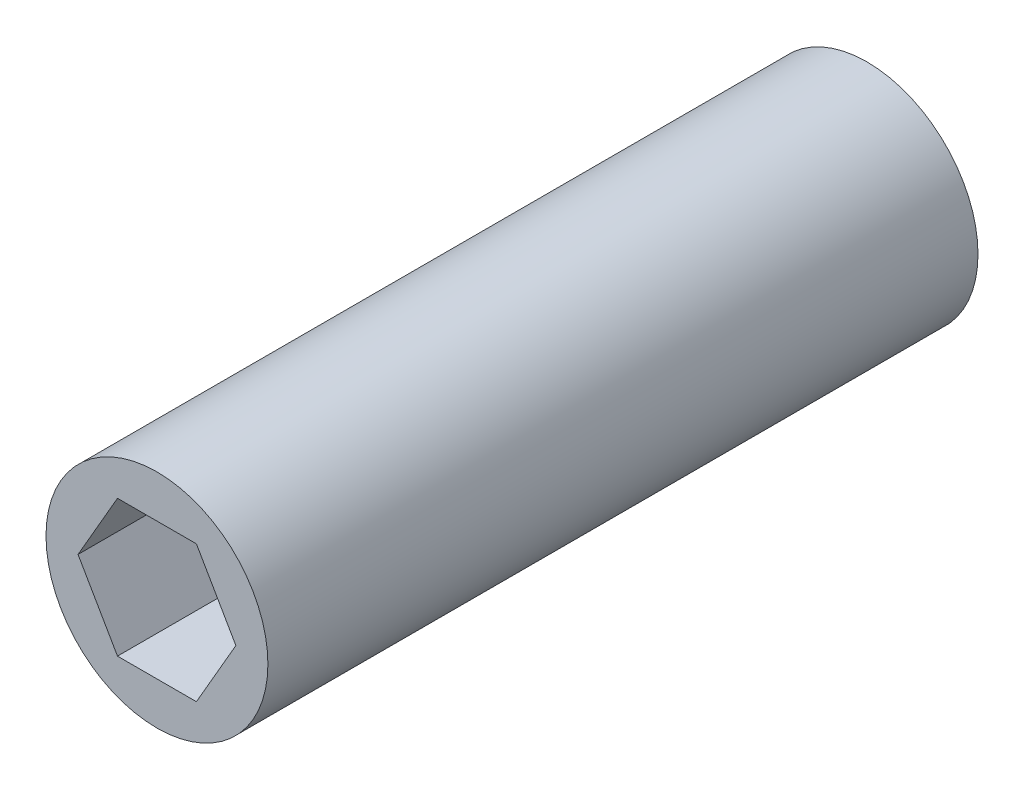
ISO-10303-21;
HEADER;
FILE_DESCRIPTION(('STEP AP214'),'2;1');
FILE_NAME('part.step','',(''),(''),'','','');
FILE_SCHEMA(('AUTOMOTIVE_DESIGN { 1 0 10303 214 1 1 1 1 }'));
ENDSEC;
DATA;
#1=APPLICATION_CONTEXT('core data for automotive mechanical design processes');
#2=APPLICATION_PROTOCOL_DEFINITION('international standard','automotive_design',2000,#1);
#3=PRODUCT_CONTEXT('',#1,'mechanical');
#4=PRODUCT('Part','Part','',(#3));
#5=PRODUCT_RELATED_PRODUCT_CATEGORY('part','',(#4));
#6=PRODUCT_DEFINITION_FORMATION('','',#4);
#7=PRODUCT_DEFINITION_CONTEXT('part definition',#1,'design');
#8=PRODUCT_DEFINITION('design','',#6,#7);
#9=PRODUCT_DEFINITION_SHAPE('','',#8);
#10=(LENGTH_UNIT() NAMED_UNIT(*) SI_UNIT(.MILLI.,.METRE.));
#11=(NAMED_UNIT(*) PLANE_ANGLE_UNIT() SI_UNIT($,.RADIAN.));
#12=(NAMED_UNIT(*) SI_UNIT($,.STERADIAN.) SOLID_ANGLE_UNIT());
#13=UNCERTAINTY_MEASURE_WITH_UNIT(LENGTH_MEASURE(1.E-05),#10,'distance_accuracy_value','');
#14=(GEOMETRIC_REPRESENTATION_CONTEXT(3) GLOBAL_UNCERTAINTY_ASSIGNED_CONTEXT((#13)) GLOBAL_UNIT_ASSIGNED_CONTEXT((#10,
#11,#12)) REPRESENTATION_CONTEXT('',''));
#15=CARTESIAN_POINT('',(0.,0.,0.));
#16=DIRECTION('',(0.,0.,1.));
#17=DIRECTION('',(1.,0.,0.));
#18=AXIS2_PLACEMENT_3D('',#15,#16,#17);
#19=CARTESIAN_POINT('',(-5.64590828240535,0.,25.4));
#20=DIRECTION('',(0.866025403784439,0.5,0.));
#21=DIRECTION('',(-0.5,0.866025403784439,0.));
#22=AXIS2_PLACEMENT_3D('',#19,#20,#21);
#23=PLANE('',#22);
#24=DIRECTION('',(-0.5,0.866025403784439,0.));
#25=VECTOR('',#24,1.);
#26=CARTESIAN_POINT('',(-2.82295414120268,-4.8895,25.4));
#27=LINE('',#26,#25);
#28=CARTESIAN_POINT('',(-2.82295414120268,-4.8895,25.4));
#29=VERTEX_POINT('',#28);
#30=CARTESIAN_POINT('',(-5.64590828240535,0.,25.4));
#31=VERTEX_POINT('',#30);
#32=EDGE_CURVE('E83',#29,#31,#27,.T.);
#33=ORIENTED_EDGE('',*,*,#32,.F.);
#34=DIRECTION('',(0.,0.,1.));
#35=VECTOR('',#34,1.);
#36=CARTESIAN_POINT('',(-2.82295414120268,-4.8895,25.4));
#37=LINE('',#36,#35);
#38=CARTESIAN_POINT('',(-2.82295414120268,-4.8895,-25.4));
#39=VERTEX_POINT('',#38);
#40=EDGE_CURVE('E75',#39,#29,#37,.T.);
#41=ORIENTED_EDGE('',*,*,#40,.F.);
#42=DIRECTION('',(-0.5,0.866025403784439,0.));
#43=VECTOR('',#42,1.);
#44=CARTESIAN_POINT('',(-2.82295414120268,-4.8895,-25.4));
#45=LINE('',#44,#43);
#46=CARTESIAN_POINT('',(-5.64590828240535,0.,-25.4));
#47=VERTEX_POINT('',#46);
#48=EDGE_CURVE('E115',#39,#47,#45,.T.);
#49=ORIENTED_EDGE('',*,*,#48,.T.);
#50=DIRECTION('',(0.,0.,1.));
#51=VECTOR('',#50,1.);
#52=CARTESIAN_POINT('',(-5.64590828240535,0.,25.4));
#53=LINE('',#52,#51);
#54=EDGE_CURVE('E100',#31,#47,#53,.F.);
#55=ORIENTED_EDGE('',*,*,#54,.F.);
#56=EDGE_LOOP('',(#33,#41,#49,#55));
#57=FACE_BOUND('',#56,.T.);
#58=ADVANCED_FACE('F16',(#57),#23,.T.);
#59=CARTESIAN_POINT('',(-2.82295414120268,4.8895,25.4));
#60=DIRECTION('',(0.866025403784439,-0.5,0.));
#61=DIRECTION('',(0.5,0.866025403784439,0.));
#62=AXIS2_PLACEMENT_3D('',#59,#60,#61);
#63=PLANE('',#62);
#64=DIRECTION('',(0.5,0.866025403784439,0.));
#65=VECTOR('',#64,1.);
#66=CARTESIAN_POINT('',(-5.64590828240535,0.,25.4));
#67=LINE('',#66,#65);
#68=CARTESIAN_POINT('',(-2.82295414120268,4.8895,25.4));
#69=VERTEX_POINT('',#68);
#70=EDGE_CURVE('E108',#31,#69,#67,.T.);
#71=ORIENTED_EDGE('',*,*,#70,.F.);
#72=ORIENTED_EDGE('',*,*,#54,.T.);
#73=DIRECTION('',(0.5,0.866025403784439,0.));
#74=VECTOR('',#73,1.);
#75=CARTESIAN_POINT('',(-5.64590828240535,0.,-25.4));
#76=LINE('',#75,#74);
#77=CARTESIAN_POINT('',(-2.82295414120268,4.8895,-25.4));
#78=VERTEX_POINT('',#77);
#79=EDGE_CURVE('E106',#47,#78,#76,.T.);
#80=ORIENTED_EDGE('',*,*,#79,.T.);
#81=DIRECTION('',(0.,0.,1.));
#82=VECTOR('',#81,1.);
#83=CARTESIAN_POINT('',(-2.82295414120268,4.8895,25.4));
#84=LINE('',#83,#82);
#85=EDGE_CURVE('E97',#69,#78,#84,.F.);
#86=ORIENTED_EDGE('',*,*,#85,.F.);
#87=EDGE_LOOP('',(#71,#72,#80,#86));
#88=FACE_BOUND('',#87,.T.);
#89=ADVANCED_FACE('F105',(#88),#63,.T.);
#90=CARTESIAN_POINT('',(2.82295414120267,4.8895,25.4));
#91=DIRECTION('',(0.,-1.,0.));
#92=DIRECTION('',(1.,0.,0.));
#93=AXIS2_PLACEMENT_3D('',#90,#91,#92);
#94=PLANE('',#93);
#95=DIRECTION('',(1.,0.,0.));
#96=VECTOR('',#95,1.);
#97=CARTESIAN_POINT('',(0.,4.8895,25.4));
#98=LINE('',#97,#96);
#99=CARTESIAN_POINT('',(2.82295414120267,4.8895,25.4));
#100=VERTEX_POINT('',#99);
#101=EDGE_CURVE('E125',#69,#100,#98,.T.);
#102=ORIENTED_EDGE('',*,*,#101,.F.);
#103=ORIENTED_EDGE('',*,*,#85,.T.);
#104=DIRECTION('',(1.,0.,0.));
#105=VECTOR('',#104,1.);
#106=CARTESIAN_POINT('',(0.,4.8895,-25.4));
#107=LINE('',#106,#105);
#108=CARTESIAN_POINT('',(2.82295414120267,4.8895,-25.4));
#109=VERTEX_POINT('',#108);
#110=EDGE_CURVE('E117',#78,#109,#107,.T.);
#111=ORIENTED_EDGE('',*,*,#110,.T.);
#112=DIRECTION('',(0.,0.,1.));
#113=VECTOR('',#112,1.);
#114=CARTESIAN_POINT('',(2.82295414120267,4.8895,25.4));
#115=LINE('',#114,#113);
#116=EDGE_CURVE('E94',#100,#109,#115,.F.);
#117=ORIENTED_EDGE('',*,*,#116,.F.);
#118=EDGE_LOOP('',(#102,#103,#111,#117));
#119=FACE_BOUND('',#118,.T.);
#120=ADVANCED_FACE('F134',(#119),#94,.T.);
#121=CARTESIAN_POINT('',(5.64590828240535,0.,25.4));
#122=DIRECTION('',(-0.866025403784438,-0.500000000000001,0.));
#123=DIRECTION('',(0.500000000000001,-0.866025403784438,0.));
#124=AXIS2_PLACEMENT_3D('',#121,#122,#123);
#125=PLANE('',#124);
#126=DIRECTION('',(0.5,-0.866025403784438,0.));
#127=VECTOR('',#126,1.);
#128=CARTESIAN_POINT('',(2.82295414120267,4.8895,25.4));
#129=LINE('',#128,#127);
#130=CARTESIAN_POINT('',(5.64590828240535,0.,25.4));
#131=VERTEX_POINT('',#130);
#132=EDGE_CURVE('E88',#100,#131,#129,.T.);
#133=ORIENTED_EDGE('',*,*,#132,.F.);
#134=ORIENTED_EDGE('',*,*,#116,.T.);
#135=DIRECTION('',(0.5,-0.866025403784438,0.));
#136=VECTOR('',#135,1.);
#137=CARTESIAN_POINT('',(2.82295414120267,4.8895,-25.4));
#138=LINE('',#137,#136);
#139=CARTESIAN_POINT('',(5.64590828240535,0.,-25.4));
#140=VERTEX_POINT('',#139);
#141=EDGE_CURVE('E119',#109,#140,#138,.T.);
#142=ORIENTED_EDGE('',*,*,#141,.T.);
#143=DIRECTION('',(0.,0.,1.));
#144=VECTOR('',#143,1.);
#145=CARTESIAN_POINT('',(5.64590828240535,0.,25.4));
#146=LINE('',#145,#144);
#147=EDGE_CURVE('E64',#131,#140,#146,.F.);
#148=ORIENTED_EDGE('',*,*,#147,.F.);
#149=EDGE_LOOP('',(#133,#134,#142,#148));
#150=FACE_BOUND('',#149,.T.);
#151=ADVANCED_FACE('F131',(#150),#125,.T.);
#152=CARTESIAN_POINT('',(2.82295414120268,-4.8895,25.4));
#153=DIRECTION('',(-0.866025403784439,0.5,0.));
#154=DIRECTION('',(-0.5,-0.866025403784439,0.));
#155=AXIS2_PLACEMENT_3D('',#152,#153,#154);
#156=PLANE('',#155);
#157=DIRECTION('',(-0.5,-0.866025403784439,0.));
#158=VECTOR('',#157,1.);
#159=CARTESIAN_POINT('',(5.64590828240535,0.,25.4));
#160=LINE('',#159,#158);
#161=CARTESIAN_POINT('',(2.82295414120268,-4.8895,25.4));
#162=VERTEX_POINT('',#161);
#163=EDGE_CURVE('E70',#131,#162,#160,.T.);
#164=ORIENTED_EDGE('',*,*,#163,.F.);
#165=ORIENTED_EDGE('',*,*,#147,.T.);
#166=DIRECTION('',(-0.5,-0.866025403784439,0.));
#167=VECTOR('',#166,1.);
#168=CARTESIAN_POINT('',(5.64590828240535,0.,-25.4));
#169=LINE('',#168,#167);
#170=CARTESIAN_POINT('',(2.82295414120268,-4.8895,-25.4));
#171=VERTEX_POINT('',#170);
#172=EDGE_CURVE('E32',#140,#171,#169,.T.);
#173=ORIENTED_EDGE('',*,*,#172,.T.);
#174=DIRECTION('',(0.,0.,1.));
#175=VECTOR('',#174,1.);
#176=CARTESIAN_POINT('',(2.82295414120268,-4.8895,25.4));
#177=LINE('',#176,#175);
#178=EDGE_CURVE('E66',#162,#171,#177,.F.);
#179=ORIENTED_EDGE('',*,*,#178,.F.);
#180=EDGE_LOOP('',(#164,#165,#173,#179));
#181=FACE_BOUND('',#180,.T.);
#182=ADVANCED_FACE('F68',(#181),#156,.T.);
#183=CARTESIAN_POINT('',(-2.82295414120268,-4.8895,25.4));
#184=DIRECTION('',(0.,1.,0.));
#185=DIRECTION('',(-1.,0.,0.));
#186=AXIS2_PLACEMENT_3D('',#183,#184,#185);
#187=PLANE('',#186);
#188=DIRECTION('',(1.,0.,0.));
#189=VECTOR('',#188,1.);
#190=CARTESIAN_POINT('',(0.,-4.8895,25.4));
#191=LINE('',#190,#189);
#192=EDGE_CURVE('E78',#162,#29,#191,.F.);
#193=ORIENTED_EDGE('',*,*,#192,.F.);
#194=ORIENTED_EDGE('',*,*,#178,.T.);
#195=DIRECTION('',(1.,0.,0.));
#196=VECTOR('',#195,1.);
#197=CARTESIAN_POINT('',(0.,-4.8895,-25.4));
#198=LINE('',#197,#196);
#199=EDGE_CURVE('E127',#171,#39,#198,.F.);
#200=ORIENTED_EDGE('',*,*,#199,.T.);
#201=ORIENTED_EDGE('',*,*,#40,.T.);
#202=EDGE_LOOP('',(#193,#194,#200,#201));
#203=FACE_BOUND('',#202,.T.);
#204=ADVANCED_FACE('F79',(#203),#187,.T.);
#205=CARTESIAN_POINT('',(0.,0.,25.4));
#206=DIRECTION('',(0.,0.,1.));
#207=DIRECTION('',(1.,0.,0.));
#208=AXIS2_PLACEMENT_3D('',#205,#206,#207);
#209=PLANE('',#208);
#210=ORIENTED_EDGE('',*,*,#101,.T.);
#211=ORIENTED_EDGE('',*,*,#132,.T.);
#212=ORIENTED_EDGE('',*,*,#163,.T.);
#213=ORIENTED_EDGE('',*,*,#192,.T.);
#214=ORIENTED_EDGE('',*,*,#32,.T.);
#215=ORIENTED_EDGE('',*,*,#70,.T.);
#216=EDGE_LOOP('',(#210,#211,#212,#213,#214,#215));
#217=FACE_BOUND('',#216,.T.);
#218=CARTESIAN_POINT('',(0.,0.,25.4));
#219=DIRECTION('',(0.,0.,-1.));
#220=DIRECTION('',(-1.,0.,0.));
#221=AXIS2_PLACEMENT_3D('',#218,#219,#220);
#222=CIRCLE('',#221,7.9375);
#223=CARTESIAN_POINT('',(-7.9375,0.,25.4));
#224=VERTEX_POINT('',#223);
#225=EDGE_CURVE('E19',#224,#224,#222,.T.);
#226=ORIENTED_EDGE('',*,*,#225,.F.);
#227=EDGE_LOOP('',(#226));
#228=FACE_BOUND('',#227,.T.);
#229=ADVANCED_FACE('F86',(#217,#228),#209,.T.);
#230=CARTESIAN_POINT('',(0.,0.,-25.4));
#231=DIRECTION('',(0.,0.,1.));
#232=DIRECTION('',(1.,0.,0.));
#233=AXIS2_PLACEMENT_3D('',#230,#231,#232);
#234=PLANE('',#233);
#235=ORIENTED_EDGE('',*,*,#172,.F.);
#236=ORIENTED_EDGE('',*,*,#141,.F.);
#237=ORIENTED_EDGE('',*,*,#110,.F.);
#238=ORIENTED_EDGE('',*,*,#79,.F.);
#239=ORIENTED_EDGE('',*,*,#48,.F.);
#240=ORIENTED_EDGE('',*,*,#199,.F.);
#241=EDGE_LOOP('',(#235,#236,#237,#238,#239,#240));
#242=FACE_BOUND('',#241,.T.);
#243=CARTESIAN_POINT('',(0.,0.,-25.4));
#244=DIRECTION('',(0.,0.,-1.));
#245=DIRECTION('',(-1.,0.,0.));
#246=AXIS2_PLACEMENT_3D('',#243,#244,#245);
#247=CIRCLE('',#246,7.9375);
#248=CARTESIAN_POINT('',(-7.9375,0.,-25.4));
#249=VERTEX_POINT('',#248);
#250=EDGE_CURVE('E10',#249,#249,#247,.F.);
#251=ORIENTED_EDGE('',*,*,#250,.F.);
#252=EDGE_LOOP('',(#251));
#253=FACE_BOUND('',#252,.T.);
#254=ADVANCED_FACE('F113',(#242,#253),#234,.F.);
#255=CARTESIAN_POINT('',(0.,0.,25.4));
#256=DIRECTION('',(0.,0.,-1.));
#257=DIRECTION('',(-1.,0.,0.));
#258=AXIS2_PLACEMENT_3D('',#255,#256,#257);
#259=CYLINDRICAL_SURFACE('',#258,7.9375);
#260=ORIENTED_EDGE('',*,*,#250,.T.);
#261=EDGE_LOOP('',(#260));
#262=FACE_BOUND('',#261,.T.);
#263=ORIENTED_EDGE('',*,*,#225,.T.);
#264=EDGE_LOOP('',(#263));
#265=FACE_BOUND('',#264,.T.);
#266=ADVANCED_FACE('F143',(#262,#265),#259,.T.);
#267=CLOSED_SHELL('',(#58,#89,#120,#151,#182,#204,#229,#254,#266));
#268=MANIFOLD_SOLID_BREP('B1',#267);
#269=ADVANCED_BREP_SHAPE_REPRESENTATION('',(#18,#268),#14);
#270=SHAPE_DEFINITION_REPRESENTATION(#9,#269);
ENDSEC;
END-ISO-10303-21;
